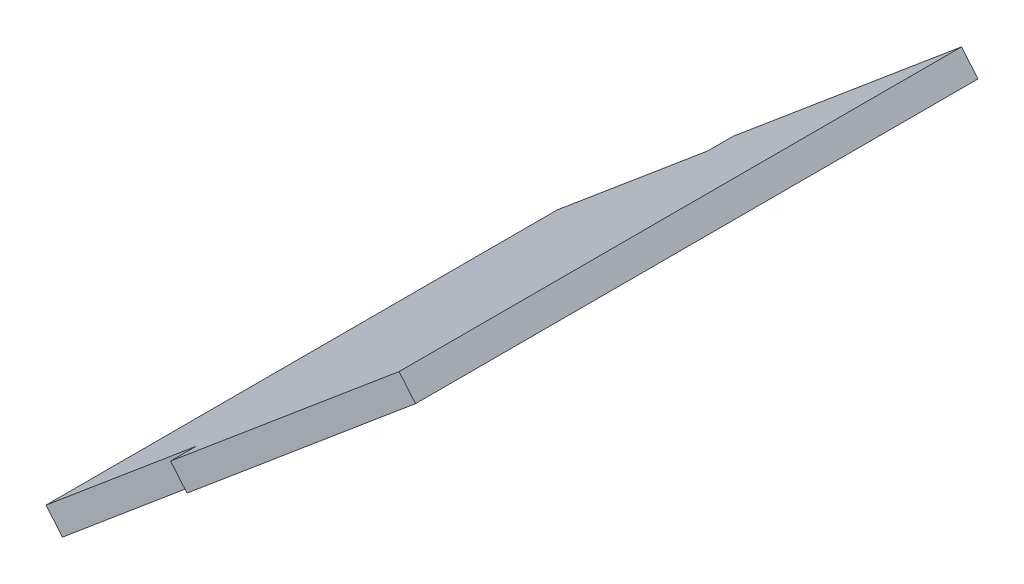
ISO-10303-21;
HEADER;
FILE_DESCRIPTION(('STEP AP214'),'2;1');
FILE_NAME('part.step','',(''),(''),'','','');
FILE_SCHEMA(('AUTOMOTIVE_DESIGN { 1 0 10303 214 1 1 1 1 }'));
ENDSEC;
DATA;
#1=APPLICATION_CONTEXT('core data for automotive mechanical design processes');
#2=APPLICATION_PROTOCOL_DEFINITION('international standard','automotive_design',2000,#1);
#3=PRODUCT_CONTEXT('',#1,'mechanical');
#4=PRODUCT('Part','Part','',(#3));
#5=PRODUCT_RELATED_PRODUCT_CATEGORY('part','',(#4));
#6=PRODUCT_DEFINITION_FORMATION('','',#4);
#7=PRODUCT_DEFINITION_CONTEXT('part definition',#1,'design');
#8=PRODUCT_DEFINITION('design','',#6,#7);
#9=PRODUCT_DEFINITION_SHAPE('','',#8);
#10=(LENGTH_UNIT() NAMED_UNIT(*) SI_UNIT(.MILLI.,.METRE.));
#11=(NAMED_UNIT(*) PLANE_ANGLE_UNIT() SI_UNIT($,.RADIAN.));
#12=(NAMED_UNIT(*) SI_UNIT($,.STERADIAN.) SOLID_ANGLE_UNIT());
#13=UNCERTAINTY_MEASURE_WITH_UNIT(LENGTH_MEASURE(1.E-05),#10,'distance_accuracy_value','');
#14=(GEOMETRIC_REPRESENTATION_CONTEXT(3) GLOBAL_UNCERTAINTY_ASSIGNED_CONTEXT((#13)) GLOBAL_UNIT_ASSIGNED_CONTEXT((#10,
#11,#12)) REPRESENTATION_CONTEXT('',''));
#15=CARTESIAN_POINT('',(0.,0.,0.));
#16=DIRECTION('',(0.,0.,1.));
#17=DIRECTION('',(1.,0.,0.));
#18=AXIS2_PLACEMENT_3D('',#15,#16,#17);
#19=CARTESIAN_POINT('',(-28.7399183382237,19.8005669903279,-66.));
#20=DIRECTION('',(0.,0.,1.));
#21=DIRECTION('',(1.,0.,0.));
#22=AXIS2_PLACEMENT_3D('',#19,#20,#21);
#23=PLANE('',#22);
#24=DIRECTION('',(-0.766044443118974,-0.642787609686544,0.));
#25=VECTOR('',#24,1.);
#26=CARTESIAN_POINT('',(-26.8115555091641,17.502433660971,-66.));
#27=LINE('',#26,#25);
#28=CARTESIAN_POINT('',(0.,40.,-66.));
#29=VERTEX_POINT('',#28);
#30=CARTESIAN_POINT('',(-26.8115555091641,17.502433660971,-66.));
#31=VERTEX_POINT('',#30);
#32=EDGE_CURVE('E136',#29,#31,#27,.T.);
#33=ORIENTED_EDGE('',*,*,#32,.T.);
#34=DIRECTION('',(0.642787609686544,-0.766044443118974,0.));
#35=VECTOR('',#34,1.);
#36=CARTESIAN_POINT('',(-28.7399183382237,19.8005669903279,-66.));
#37=LINE('',#36,#35);
#38=CARTESIAN_POINT('',(-28.7399183382237,19.8005669903279,-66.));
#39=VERTEX_POINT('',#38);
#40=EDGE_CURVE('E43',#39,#31,#37,.T.);
#41=ORIENTED_EDGE('',*,*,#40,.F.);
#42=DIRECTION('',(-0.766044443118974,-0.642787609686544,0.));
#43=VECTOR('',#42,1.);
#44=CARTESIAN_POINT('',(-28.7399183382237,19.8005669903279,-66.));
#45=LINE('',#44,#43);
#46=CARTESIAN_POINT('',(-1.92836282905965,42.2981333293569,-66.));
#47=VERTEX_POINT('',#46);
#48=EDGE_CURVE('E96',#47,#39,#45,.T.);
#49=ORIENTED_EDGE('',*,*,#48,.F.);
#50=DIRECTION('',(0.642787609686544,-0.766044443118974,0.));
#51=VECTOR('',#50,1.);
#52=CARTESIAN_POINT('',(-1.92836282905965,42.2981333293569,-66.));
#53=LINE('',#52,#51);
#54=EDGE_CURVE('E11',#47,#29,#53,.T.);
#55=ORIENTED_EDGE('',*,*,#54,.T.);
#56=EDGE_LOOP('',(#33,#41,#49,#55));
#57=FACE_BOUND('',#56,.T.);
#58=ADVANCED_FACE('F35',(#57),#23,.F.);
#59=CARTESIAN_POINT('',(-28.7399183382237,19.8005669903279,-63.));
#60=DIRECTION('',(0.766044443118974,0.642787609686544,0.));
#61=DIRECTION('',(-0.642787609686544,0.766044443118974,0.));
#62=AXIS2_PLACEMENT_3D('',#59,#60,#61);
#63=PLANE('',#62);
#64=DIRECTION('',(0.,0.,1.));
#65=VECTOR('',#64,1.);
#66=CARTESIAN_POINT('',(-26.8115555091641,17.502433660971,-63.));
#67=LINE('',#66,#65);
#68=CARTESIAN_POINT('',(-26.8115555091641,17.502433660971,-63.));
#69=VERTEX_POINT('',#68);
#70=EDGE_CURVE('E138',#31,#69,#67,.T.);
#71=ORIENTED_EDGE('',*,*,#70,.T.);
#72=DIRECTION('',(0.642787609686544,-0.766044443118974,0.));
#73=VECTOR('',#72,1.);
#74=CARTESIAN_POINT('',(-28.7399183382237,19.8005669903279,-63.));
#75=LINE('',#74,#73);
#76=CARTESIAN_POINT('',(-28.7399183382237,19.8005669903279,-63.));
#77=VERTEX_POINT('',#76);
#78=EDGE_CURVE('E155',#77,#69,#75,.T.);
#79=ORIENTED_EDGE('',*,*,#78,.F.);
#80=DIRECTION('',(0.,0.,1.));
#81=VECTOR('',#80,1.);
#82=CARTESIAN_POINT('',(-28.7399183382237,19.8005669903279,-63.));
#83=LINE('',#82,#81);
#84=EDGE_CURVE('E163',#39,#77,#83,.T.);
#85=ORIENTED_EDGE('',*,*,#84,.F.);
#86=ORIENTED_EDGE('',*,*,#40,.T.);
#87=EDGE_LOOP('',(#71,#79,#85,#86));
#88=FACE_BOUND('',#87,.T.);
#89=ADVANCED_FACE('F161',(#88),#63,.F.);
#90=CARTESIAN_POINT('',(-28.7399183382237,19.8005669903279,-63.));
#91=DIRECTION('',(0.,0.,1.));
#92=DIRECTION('',(1.,0.,0.));
#93=AXIS2_PLACEMENT_3D('',#90,#91,#92);
#94=PLANE('',#93);
#95=DIRECTION('',(-0.766044443118974,-0.642787609686544,0.));
#96=VECTOR('',#95,1.);
#97=CARTESIAN_POINT('',(-26.8115555091641,17.502433660971,-63.));
#98=LINE('',#97,#96);
#99=CARTESIAN_POINT('',(-44.4305777009005,2.71831863818048,-63.));
#100=VERTEX_POINT('',#99);
#101=EDGE_CURVE('E140',#69,#100,#98,.T.);
#102=ORIENTED_EDGE('',*,*,#101,.T.);
#103=DIRECTION('',(0.642787609686544,-0.766044443118974,0.));
#104=VECTOR('',#103,1.);
#105=CARTESIAN_POINT('',(-46.3589405299601,5.01645196753741,-63.));
#106=LINE('',#105,#104);
#107=CARTESIAN_POINT('',(-46.3589405299601,5.01645196753741,-63.));
#108=VERTEX_POINT('',#107);
#109=EDGE_CURVE('E152',#108,#100,#106,.T.);
#110=ORIENTED_EDGE('',*,*,#109,.F.);
#111=DIRECTION('',(-0.766044443118974,-0.642787609686544,0.));
#112=VECTOR('',#111,1.);
#113=CARTESIAN_POINT('',(-28.7399183382237,19.8005669903279,-63.));
#114=LINE('',#113,#112);
#115=EDGE_CURVE('E173',#77,#108,#114,.T.);
#116=ORIENTED_EDGE('',*,*,#115,.F.);
#117=ORIENTED_EDGE('',*,*,#78,.T.);
#118=EDGE_LOOP('',(#102,#110,#116,#117));
#119=FACE_BOUND('',#118,.T.);
#120=ADVANCED_FACE('F169',(#119),#94,.F.);
#121=CARTESIAN_POINT('',(-46.3589405299601,5.01645196753741,-63.));
#122=DIRECTION('',(0.766044443118974,0.642787609686544,0.));
#123=DIRECTION('',(-0.642787609686544,0.766044443118974,0.));
#124=AXIS2_PLACEMENT_3D('',#121,#122,#123);
#125=PLANE('',#124);
#126=DIRECTION('',(0.,0.,1.));
#127=VECTOR('',#126,1.);
#128=CARTESIAN_POINT('',(-44.4305777009005,2.71831863818048,-63.));
#129=LINE('',#128,#127);
#130=CARTESIAN_POINT('',(-44.4305777009005,2.71831863818049,-3.00000000000002));
#131=VERTEX_POINT('',#130);
#132=EDGE_CURVE('E142',#100,#131,#129,.T.);
#133=ORIENTED_EDGE('',*,*,#132,.T.);
#134=DIRECTION('',(0.642787609686544,-0.766044443118974,0.));
#135=VECTOR('',#134,1.);
#136=CARTESIAN_POINT('',(-46.3589405299601,5.01645196753741,-3.00000000000002));
#137=LINE('',#136,#135);
#138=CARTESIAN_POINT('',(-46.3589405299601,5.01645196753741,-3.00000000000002));
#139=VERTEX_POINT('',#138);
#140=EDGE_CURVE('E125',#139,#131,#137,.T.);
#141=ORIENTED_EDGE('',*,*,#140,.F.);
#142=DIRECTION('',(0.,0.,1.));
#143=VECTOR('',#142,1.);
#144=CARTESIAN_POINT('',(-46.3589405299601,5.01645196753741,-63.));
#145=LINE('',#144,#143);
#146=EDGE_CURVE('E116',#108,#139,#145,.T.);
#147=ORIENTED_EDGE('',*,*,#146,.F.);
#148=ORIENTED_EDGE('',*,*,#109,.T.);
#149=EDGE_LOOP('',(#133,#141,#147,#148));
#150=FACE_BOUND('',#149,.T.);
#151=ADVANCED_FACE('F172',(#150),#125,.F.);
#152=CARTESIAN_POINT('',(-28.7399183382237,19.8005669903279,-3.00000000000002));
#153=DIRECTION('',(0.,0.,-1.));
#154=DIRECTION('',(-1.,0.,0.));
#155=AXIS2_PLACEMENT_3D('',#152,#153,#154);
#156=PLANE('',#155);
#157=DIRECTION('',(0.766044443118974,0.642787609686544,0.));
#158=VECTOR('',#157,1.);
#159=CARTESIAN_POINT('',(-26.8115555091641,17.502433660971,-3.00000000000002));
#160=LINE('',#159,#158);
#161=CARTESIAN_POINT('',(-26.8115555091641,17.502433660971,-3.00000000000002));
#162=VERTEX_POINT('',#161);
#163=EDGE_CURVE('E124',#131,#162,#160,.T.);
#164=ORIENTED_EDGE('',*,*,#163,.T.);
#165=DIRECTION('',(0.642787609686544,-0.766044443118974,0.));
#166=VECTOR('',#165,1.);
#167=CARTESIAN_POINT('',(-28.7399183382237,19.8005669903279,-3.00000000000002));
#168=LINE('',#167,#166);
#169=CARTESIAN_POINT('',(-28.7399183382237,19.8005669903279,-3.00000000000002));
#170=VERTEX_POINT('',#169);
#171=EDGE_CURVE('E121',#170,#162,#168,.T.);
#172=ORIENTED_EDGE('',*,*,#171,.F.);
#173=DIRECTION('',(0.766044443118974,0.642787609686544,0.));
#174=VECTOR('',#173,1.);
#175=CARTESIAN_POINT('',(-28.7399183382237,19.8005669903279,-3.00000000000002));
#176=LINE('',#175,#174);
#177=EDGE_CURVE('E110',#139,#170,#176,.T.);
#178=ORIENTED_EDGE('',*,*,#177,.F.);
#179=ORIENTED_EDGE('',*,*,#140,.T.);
#180=EDGE_LOOP('',(#164,#172,#178,#179));
#181=FACE_BOUND('',#180,.T.);
#182=ADVANCED_FACE('F122',(#181),#156,.F.);
#183=CARTESIAN_POINT('',(-28.7399183382237,19.8005669903279,0.));
#184=DIRECTION('',(0.766044443118974,0.642787609686544,0.));
#185=DIRECTION('',(-0.642787609686544,0.766044443118974,0.));
#186=AXIS2_PLACEMENT_3D('',#183,#184,#185);
#187=PLANE('',#186);
#188=DIRECTION('',(0.,0.,1.));
#189=VECTOR('',#188,1.);
#190=CARTESIAN_POINT('',(-26.8115555091641,17.502433660971,0.));
#191=LINE('',#190,#189);
#192=CARTESIAN_POINT('',(-26.8115555091641,17.502433660971,0.));
#193=VERTEX_POINT('',#192);
#194=EDGE_CURVE('E81',#162,#193,#191,.T.);
#195=ORIENTED_EDGE('',*,*,#194,.T.);
#196=DIRECTION('',(0.642787609686544,-0.766044443118974,0.));
#197=VECTOR('',#196,1.);
#198=CARTESIAN_POINT('',(-28.7399183382237,19.8005669903279,0.));
#199=LINE('',#198,#197);
#200=CARTESIAN_POINT('',(-28.7399183382237,19.8005669903279,0.));
#201=VERTEX_POINT('',#200);
#202=EDGE_CURVE('E126',#201,#193,#199,.T.);
#203=ORIENTED_EDGE('',*,*,#202,.F.);
#204=DIRECTION('',(0.,0.,1.));
#205=VECTOR('',#204,1.);
#206=CARTESIAN_POINT('',(-28.7399183382237,19.8005669903279,0.));
#207=LINE('',#206,#205);
#208=EDGE_CURVE('E114',#170,#201,#207,.T.);
#209=ORIENTED_EDGE('',*,*,#208,.F.);
#210=ORIENTED_EDGE('',*,*,#171,.T.);
#211=EDGE_LOOP('',(#195,#203,#209,#210));
#212=FACE_BOUND('',#211,.T.);
#213=ADVANCED_FACE('F128',(#212),#187,.F.);
#214=CARTESIAN_POINT('',(-1.92836282905965,42.2981333293569,0.));
#215=DIRECTION('',(0.,0.,-1.));
#216=DIRECTION('',(-1.,0.,0.));
#217=AXIS2_PLACEMENT_3D('',#214,#215,#216);
#218=PLANE('',#217);
#219=DIRECTION('',(0.766044443118974,0.642787609686544,0.));
#220=VECTOR('',#219,1.);
#221=CARTESIAN_POINT('',(0.,40.,0.));
#222=LINE('',#221,#220);
#223=CARTESIAN_POINT('',(0.,40.,0.));
#224=VERTEX_POINT('',#223);
#225=EDGE_CURVE('E146',#193,#224,#222,.T.);
#226=ORIENTED_EDGE('',*,*,#225,.T.);
#227=DIRECTION('',(0.642787609686544,-0.766044443118974,0.));
#228=VECTOR('',#227,1.);
#229=CARTESIAN_POINT('',(-1.92836282905965,42.2981333293569,0.));
#230=LINE('',#229,#228);
#231=CARTESIAN_POINT('',(-1.92836282905965,42.2981333293569,0.));
#232=VERTEX_POINT('',#231);
#233=EDGE_CURVE('E132',#232,#224,#230,.T.);
#234=ORIENTED_EDGE('',*,*,#233,.F.);
#235=DIRECTION('',(0.766044443118974,0.642787609686544,0.));
#236=VECTOR('',#235,1.);
#237=CARTESIAN_POINT('',(-1.92836282905965,42.2981333293569,0.));
#238=LINE('',#237,#236);
#239=EDGE_CURVE('E130',#201,#232,#238,.T.);
#240=ORIENTED_EDGE('',*,*,#239,.F.);
#241=ORIENTED_EDGE('',*,*,#202,.T.);
#242=EDGE_LOOP('',(#226,#234,#240,#241));
#243=FACE_BOUND('',#242,.T.);
#244=ADVANCED_FACE('F195',(#243),#218,.F.);
#245=CARTESIAN_POINT('',(-1.92836282905965,42.2981333293569,-63.));
#246=DIRECTION('',(-0.766044443118974,-0.642787609686544,0.));
#247=DIRECTION('',(0.642787609686544,-0.766044443118974,0.));
#248=AXIS2_PLACEMENT_3D('',#245,#246,#247);
#249=PLANE('',#248);
#250=DIRECTION('',(0.,0.,-1.));
#251=VECTOR('',#250,1.);
#252=CARTESIAN_POINT('',(0.,40.,-63.));
#253=LINE('',#252,#251);
#254=EDGE_CURVE('E88',#224,#29,#253,.T.);
#255=ORIENTED_EDGE('',*,*,#254,.T.);
#256=ORIENTED_EDGE('',*,*,#54,.F.);
#257=DIRECTION('',(0.,0.,-1.));
#258=VECTOR('',#257,1.);
#259=CARTESIAN_POINT('',(-1.92836282905965,42.2981333293569,-66.));
#260=LINE('',#259,#258);
#261=EDGE_CURVE('E51',#232,#47,#260,.T.);
#262=ORIENTED_EDGE('',*,*,#261,.F.);
#263=ORIENTED_EDGE('',*,*,#233,.T.);
#264=EDGE_LOOP('',(#255,#256,#262,#263));
#265=FACE_BOUND('',#264,.T.);
#266=ADVANCED_FACE('F179',(#265),#249,.F.);
#267=CARTESIAN_POINT('',(-21.6245178893038,25.7710968826953,0.));
#268=DIRECTION('',(0.642787609686544,-0.766044443118974,0.));
#269=DIRECTION('',(0.766044443118974,0.642787609686544,0.));
#270=AXIS2_PLACEMENT_3D('',#267,#268,#269);
#271=PLANE('',#270);
#272=ORIENTED_EDGE('',*,*,#261,.T.);
#273=ORIENTED_EDGE('',*,*,#48,.T.);
#274=ORIENTED_EDGE('',*,*,#84,.T.);
#275=ORIENTED_EDGE('',*,*,#115,.T.);
#276=ORIENTED_EDGE('',*,*,#146,.T.);
#277=ORIENTED_EDGE('',*,*,#177,.T.);
#278=ORIENTED_EDGE('',*,*,#208,.T.);
#279=ORIENTED_EDGE('',*,*,#239,.T.);
#280=EDGE_LOOP('',(#272,#273,#274,#275,#276,#277,#278,#279));
#281=FACE_BOUND('',#280,.T.);
#282=ADVANCED_FACE('F112',(#281),#271,.F.);
#283=CARTESIAN_POINT('',(-19.6961550602442,23.4729635533384,0.));
#284=DIRECTION('',(0.642787609686544,-0.766044443118974,0.));
#285=DIRECTION('',(0.766044443118974,0.642787609686544,0.));
#286=AXIS2_PLACEMENT_3D('',#283,#284,#285);
#287=PLANE('',#286);
#288=ORIENTED_EDGE('',*,*,#32,.F.);
#289=ORIENTED_EDGE('',*,*,#254,.F.);
#290=ORIENTED_EDGE('',*,*,#225,.F.);
#291=ORIENTED_EDGE('',*,*,#194,.F.);
#292=ORIENTED_EDGE('',*,*,#163,.F.);
#293=ORIENTED_EDGE('',*,*,#132,.F.);
#294=ORIENTED_EDGE('',*,*,#101,.F.);
#295=ORIENTED_EDGE('',*,*,#70,.F.);
#296=EDGE_LOOP('',(#288,#289,#290,#291,#292,#293,#294,#295));
#297=FACE_BOUND('',#296,.T.);
#298=ADVANCED_FACE('F165',(#297),#287,.T.);
#299=CLOSED_SHELL('',(#58,#89,#120,#151,#182,#213,#244,#266,#282,#298));
#300=MANIFOLD_SOLID_BREP('B2',#299);
#301=ADVANCED_BREP_SHAPE_REPRESENTATION('',(#18,#300),#14);
#302=SHAPE_DEFINITION_REPRESENTATION(#9,#301);
ENDSEC;
END-ISO-10303-21;
